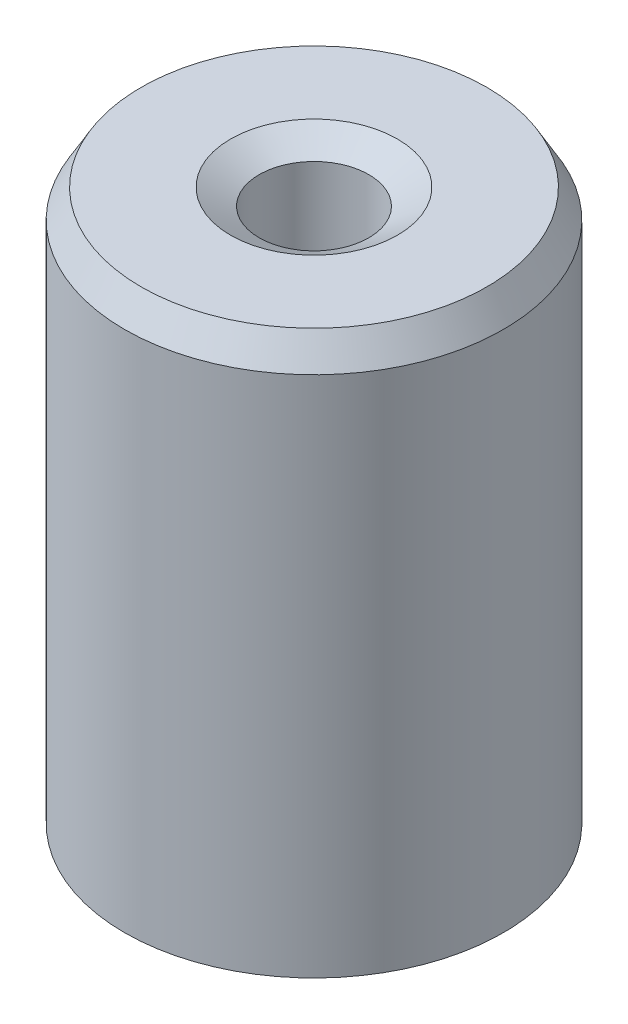
ISO-10303-21;
HEADER;
FILE_DESCRIPTION(('STEP AP214'),'2;1');
FILE_NAME('part.step','',(''),(''),'','','');
FILE_SCHEMA(('AUTOMOTIVE_DESIGN { 1 0 10303 214 1 1 1 1 }'));
ENDSEC;
DATA;
#1=APPLICATION_CONTEXT('core data for automotive mechanical design processes');
#2=APPLICATION_PROTOCOL_DEFINITION('international standard','automotive_design',2000,#1);
#3=PRODUCT_CONTEXT('',#1,'mechanical');
#4=PRODUCT('Part','Part','',(#3));
#5=PRODUCT_RELATED_PRODUCT_CATEGORY('part','',(#4));
#6=PRODUCT_DEFINITION_FORMATION('','',#4);
#7=PRODUCT_DEFINITION_CONTEXT('part definition',#1,'design');
#8=PRODUCT_DEFINITION('design','',#6,#7);
#9=PRODUCT_DEFINITION_SHAPE('','',#8);
#10=(LENGTH_UNIT() NAMED_UNIT(*) SI_UNIT(.MILLI.,.METRE.));
#11=(NAMED_UNIT(*) PLANE_ANGLE_UNIT() SI_UNIT($,.RADIAN.));
#12=(NAMED_UNIT(*) SI_UNIT($,.STERADIAN.) SOLID_ANGLE_UNIT());
#13=UNCERTAINTY_MEASURE_WITH_UNIT(LENGTH_MEASURE(1.E-05),#10,'distance_accuracy_value','');
#14=(GEOMETRIC_REPRESENTATION_CONTEXT(3) GLOBAL_UNCERTAINTY_ASSIGNED_CONTEXT((#13)) GLOBAL_UNIT_ASSIGNED_CONTEXT((#10,
#11,#12)) REPRESENTATION_CONTEXT('',''));
#15=CARTESIAN_POINT('',(0.,0.,0.));
#16=DIRECTION('',(0.,0.,1.));
#17=DIRECTION('',(1.,0.,0.));
#18=AXIS2_PLACEMENT_3D('',#15,#16,#17);
#19=CARTESIAN_POINT('',(0.,14.983907351019,0.));
#20=DIRECTION('',(0.,-1.,0.));
#21=DIRECTION('',(0.,0.,-1.));
#22=AXIS2_PLACEMENT_3D('',#19,#20,#21);
#23=CYLINDRICAL_SURFACE('',#22,5.);
#24=CARTESIAN_POINT('',(0.,0.436226728381213,0.));
#25=DIRECTION('',(0.,1.,0.));
#26=DIRECTION('',(0.,0.,1.));
#27=AXIS2_PLACEMENT_3D('',#24,#25,#26);
#28=CIRCLE('',#27,5.);
#29=CARTESIAN_POINT('',(0.,0.436226728381213,5.));
#30=VERTEX_POINT('',#29);
#31=EDGE_CURVE('E10',#30,#30,#28,.T.);
#32=ORIENTED_EDGE('',*,*,#31,.T.);
#33=EDGE_LOOP('',(#32));
#34=FACE_BOUND('',#33,.T.);
#35=CARTESIAN_POINT('',(0.,14.2283404938432,0.));
#36=DIRECTION('',(0.,1.,0.));
#37=DIRECTION('',(0.,0.,1.));
#38=AXIS2_PLACEMENT_3D('',#35,#36,#37);
#39=CIRCLE('',#38,5.);
#40=CARTESIAN_POINT('',(0.,14.2283404938432,5.));
#41=VERTEX_POINT('',#40);
#42=EDGE_CURVE('E50',#41,#41,#39,.F.);
#43=ORIENTED_EDGE('',*,*,#42,.T.);
#44=EDGE_LOOP('',(#43));
#45=FACE_BOUND('',#44,.T.);
#46=ADVANCED_FACE('F39',(#34,#45),#23,.T.);
#47=CARTESIAN_POINT('',(0.,14.983907351019,0.));
#48=DIRECTION('',(0.,1.,0.));
#49=DIRECTION('',(0.,0.,1.));
#50=AXIS2_PLACEMENT_3D('',#47,#48,#49);
#51=PLANE('',#50);
#52=CARTESIAN_POINT('',(0.,14.983907351019,0.));
#53=DIRECTION('',(0.,1.,0.));
#54=DIRECTION('',(0.,0.,1.));
#55=AXIS2_PLACEMENT_3D('',#52,#53,#54);
#56=CIRCLE('',#55,2.20192718411532);
#57=CARTESIAN_POINT('',(0.,14.983907351019,2.20192718411532));
#58=VERTEX_POINT('',#57);
#59=EDGE_CURVE('E58',#58,#58,#56,.F.);
#60=ORIENTED_EDGE('',*,*,#59,.T.);
#61=EDGE_LOOP('',(#60));
#62=FACE_BOUND('',#61,.T.);
#63=CARTESIAN_POINT('',(0.,14.983907351019,0.));
#64=DIRECTION('',(0.,1.,0.));
#65=DIRECTION('',(0.,0.,1.));
#66=AXIS2_PLACEMENT_3D('',#63,#64,#65);
#67=CIRCLE('',#66,4.56377327161878);
#68=CARTESIAN_POINT('',(0.,14.983907351019,4.56377327161878));
#69=VERTEX_POINT('',#68);
#70=EDGE_CURVE('E61',#69,#69,#67,.T.);
#71=ORIENTED_EDGE('',*,*,#70,.T.);
#72=EDGE_LOOP('',(#71));
#73=FACE_BOUND('',#72,.T.);
#74=ADVANCED_FACE('F88',(#62,#73),#51,.T.);
#75=CARTESIAN_POINT('',(0.,0.,0.));
#76=DIRECTION('',(0.,1.,0.));
#77=DIRECTION('',(0.,0.,1.));
#78=AXIS2_PLACEMENT_3D('',#75,#76,#77);
#79=PLANE('',#78);
#80=CARTESIAN_POINT('',(0.,0.,0.));
#81=DIRECTION('',(0.,1.,0.));
#82=DIRECTION('',(0.,0.,1.));
#83=AXIS2_PLACEMENT_3D('',#80,#81,#82);
#84=CIRCLE('',#83,1.88258705532071);
#85=CARTESIAN_POINT('',(0.,0.,1.88258705532071));
#86=VERTEX_POINT('',#85);
#87=EDGE_CURVE('E51',#86,#86,#84,.T.);
#88=ORIENTED_EDGE('',*,*,#87,.T.);
#89=EDGE_LOOP('',(#88));
#90=FACE_BOUND('',#89,.T.);
#91=CARTESIAN_POINT('',(0.,0.,0.));
#92=DIRECTION('',(0.,1.,0.));
#93=DIRECTION('',(0.,0.,1.));
#94=AXIS2_PLACEMENT_3D('',#91,#92,#93);
#95=CIRCLE('',#94,4.24443314282418);
#96=CARTESIAN_POINT('',(0.,0.,4.24443314282418));
#97=VERTEX_POINT('',#96);
#98=EDGE_CURVE('E54',#97,#97,#95,.F.);
#99=ORIENTED_EDGE('',*,*,#98,.T.);
#100=EDGE_LOOP('',(#99));
#101=FACE_BOUND('',#100,.T.);
#102=ADVANCED_FACE('F83',(#90,#101),#79,.F.);
#103=CARTESIAN_POINT('',(0.,14.983907351019,0.));
#104=DIRECTION('',(0.,-1.,0.));
#105=DIRECTION('',(0.,0.,-1.));
#106=AXIS2_PLACEMENT_3D('',#103,#104,#105);
#107=CYLINDRICAL_SURFACE('',#106,1.4463603269395);
#108=CARTESIAN_POINT('',(0.,14.5476806226378,0.));
#109=DIRECTION('',(0.,1.,0.));
#110=DIRECTION('',(0.,0.,1.));
#111=AXIS2_PLACEMENT_3D('',#108,#109,#110);
#112=CIRCLE('',#111,1.4463603269395);
#113=CARTESIAN_POINT('',(0.,14.5476806226378,1.4463603269395));
#114=VERTEX_POINT('',#113);
#115=EDGE_CURVE('E67',#114,#114,#112,.T.);
#116=ORIENTED_EDGE('',*,*,#115,.T.);
#117=EDGE_LOOP('',(#116));
#118=FACE_BOUND('',#117,.T.);
#119=CARTESIAN_POINT('',(0.,0.755566857175817,0.));
#120=DIRECTION('',(0.,1.,0.));
#121=DIRECTION('',(0.,0.,1.));
#122=AXIS2_PLACEMENT_3D('',#119,#120,#121);
#123=CIRCLE('',#122,1.4463603269395);
#124=CARTESIAN_POINT('',(0.,0.755566857175817,1.4463603269395));
#125=VERTEX_POINT('',#124);
#126=EDGE_CURVE('E69',#125,#125,#123,.F.);
#127=ORIENTED_EDGE('',*,*,#126,.T.);
#128=EDGE_LOOP('',(#127));
#129=FACE_BOUND('',#128,.T.);
#130=ADVANCED_FACE('F71',(#118,#129),#107,.F.);
#131=CARTESIAN_POINT('',(0.,14.5476806226378,0.));
#132=DIRECTION('',(0.,1.,0.));
#133=DIRECTION('',(0.,0.,1.));
#134=AXIS2_PLACEMENT_3D('',#131,#132,#133);
#135=CONICAL_SURFACE('',#134,1.4463603269395,1.0471975511966);
#136=ORIENTED_EDGE('',*,*,#59,.F.);
#137=EDGE_LOOP('',(#136));
#138=FACE_BOUND('',#137,.T.);
#139=ORIENTED_EDGE('',*,*,#115,.F.);
#140=EDGE_LOOP('',(#139));
#141=FACE_BOUND('',#140,.T.);
#142=ADVANCED_FACE('F77',(#138,#141),#135,.F.);
#143=CARTESIAN_POINT('',(0.,0.,0.));
#144=DIRECTION('',(0.,-1.,0.));
#145=DIRECTION('',(0.,0.,-1.));
#146=AXIS2_PLACEMENT_3D('',#143,#144,#145);
#147=CONICAL_SURFACE('',#146,1.88258705532071,0.523598775598295);
#148=ORIENTED_EDGE('',*,*,#126,.F.);
#149=EDGE_LOOP('',(#148));
#150=FACE_BOUND('',#149,.T.);
#151=ORIENTED_EDGE('',*,*,#87,.F.);
#152=EDGE_LOOP('',(#151));
#153=FACE_BOUND('',#152,.T.);
#154=ADVANCED_FACE('F73',(#150,#153),#147,.F.);
#155=CARTESIAN_POINT('',(0.,0.436226728381213,0.));
#156=DIRECTION('',(0.,1.,0.));
#157=DIRECTION('',(0.,0.,1.));
#158=AXIS2_PLACEMENT_3D('',#155,#156,#157);
#159=CONICAL_SURFACE('',#158,5.,1.0471975511966);
#160=ORIENTED_EDGE('',*,*,#98,.F.);
#161=EDGE_LOOP('',(#160));
#162=FACE_BOUND('',#161,.T.);
#163=ORIENTED_EDGE('',*,*,#31,.F.);
#164=EDGE_LOOP('',(#163));
#165=FACE_BOUND('',#164,.T.);
#166=ADVANCED_FACE('F76',(#162,#165),#159,.T.);
#167=CARTESIAN_POINT('',(0.,14.983907351019,0.));
#168=DIRECTION('',(0.,-1.,0.));
#169=DIRECTION('',(0.,0.,-1.));
#170=AXIS2_PLACEMENT_3D('',#167,#168,#169);
#171=CONICAL_SURFACE('',#170,4.56377327161878,0.523598775598295);
#172=ORIENTED_EDGE('',*,*,#42,.F.);
#173=EDGE_LOOP('',(#172));
#174=FACE_BOUND('',#173,.T.);
#175=ORIENTED_EDGE('',*,*,#70,.F.);
#176=EDGE_LOOP('',(#175));
#177=FACE_BOUND('',#176,.T.);
#178=ADVANCED_FACE('F45',(#174,#177),#171,.T.);
#179=CLOSED_SHELL('',(#46,#74,#102,#130,#142,#154,#166,#178));
#180=MANIFOLD_SOLID_BREP('B2',#179);
#181=ADVANCED_BREP_SHAPE_REPRESENTATION('',(#18,#180),#14);
#182=SHAPE_DEFINITION_REPRESENTATION(#9,#181);
ENDSEC;
END-ISO-10303-21;
